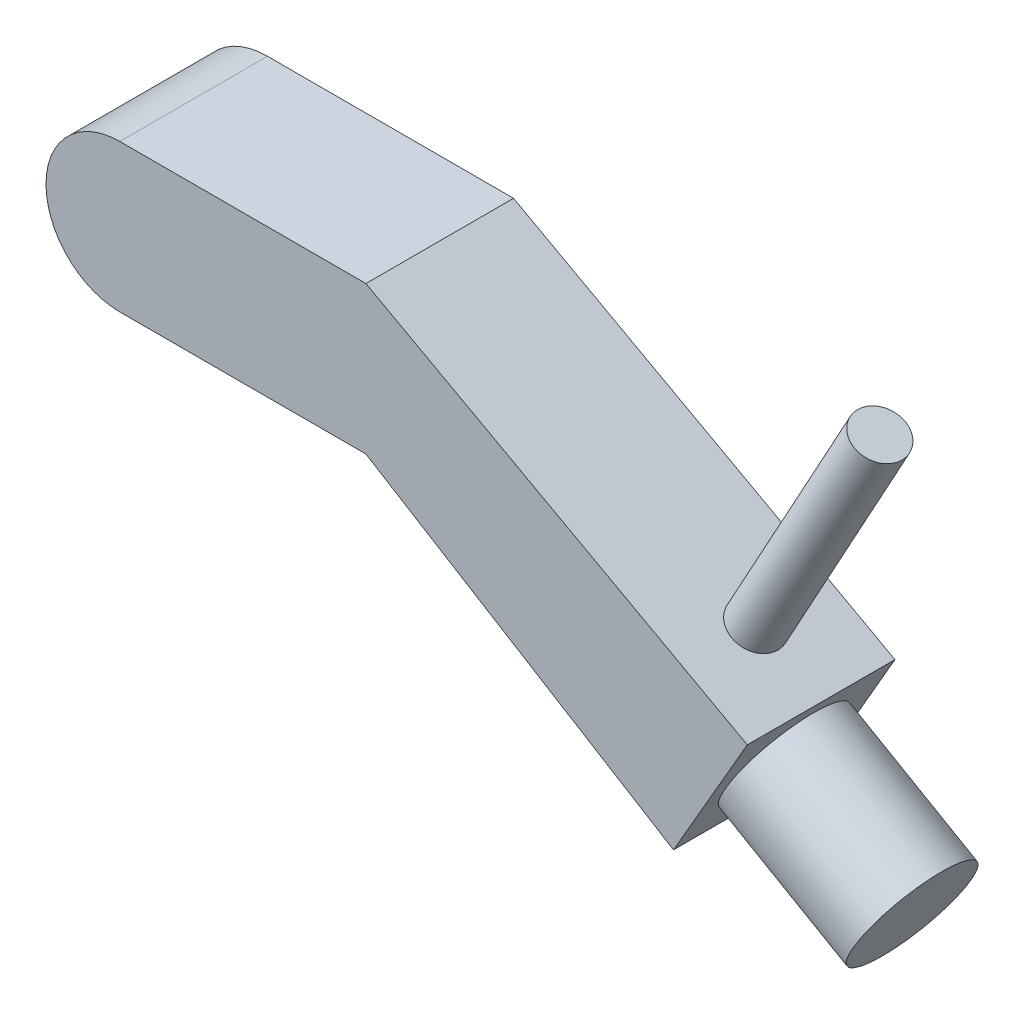
ISO-10303-21;
HEADER;
FILE_DESCRIPTION(('STEP AP214'),'2;1');
FILE_NAME('part.step','',(''),(''),'','','');
FILE_SCHEMA(('AUTOMOTIVE_DESIGN { 1 0 10303 214 1 1 1 1 }'));
ENDSEC;
DATA;
#1=APPLICATION_CONTEXT('core data for automotive mechanical design processes');
#2=APPLICATION_PROTOCOL_DEFINITION('international standard','automotive_design',2000,#1);
#3=PRODUCT_CONTEXT('',#1,'mechanical');
#4=PRODUCT('Part','Part','',(#3));
#5=PRODUCT_RELATED_PRODUCT_CATEGORY('part','',(#4));
#6=PRODUCT_DEFINITION_FORMATION('','',#4);
#7=PRODUCT_DEFINITION_CONTEXT('part definition',#1,'design');
#8=PRODUCT_DEFINITION('design','',#6,#7);
#9=PRODUCT_DEFINITION_SHAPE('','',#8);
#10=(LENGTH_UNIT() NAMED_UNIT(*) SI_UNIT(.MILLI.,.METRE.));
#11=(NAMED_UNIT(*) PLANE_ANGLE_UNIT() SI_UNIT($,.RADIAN.));
#12=(NAMED_UNIT(*) SI_UNIT($,.STERADIAN.) SOLID_ANGLE_UNIT());
#13=UNCERTAINTY_MEASURE_WITH_UNIT(LENGTH_MEASURE(1.E-05),#10,'distance_accuracy_value','');
#14=(GEOMETRIC_REPRESENTATION_CONTEXT(3) GLOBAL_UNCERTAINTY_ASSIGNED_CONTEXT((#13)) GLOBAL_UNIT_ASSIGNED_CONTEXT((#10,
#11,#12)) REPRESENTATION_CONTEXT('',''));
#15=CARTESIAN_POINT('',(0.,0.,0.));
#16=DIRECTION('',(0.,0.,1.));
#17=DIRECTION('',(1.,0.,0.));
#18=AXIS2_PLACEMENT_3D('',#15,#16,#17);
#19=CARTESIAN_POINT('',(50.,15.,15.));
#20=DIRECTION('',(-0.480172354752716,-0.877174161572964,0.));
#21=DIRECTION('',(0.877174161572964,-0.480172354752716,0.));
#22=AXIS2_PLACEMENT_3D('',#19,#20,#21);
#23=PLANE('',#22);
#24=CARTESIAN_POINT('',(114.342387576406,-20.2215524652166,0.));
#25=DIRECTION('',(-0.480172354752716,-0.877174161572964,0.));
#26=DIRECTION('',(0.877174161572964,-0.480172354752716,0.));
#27=AXIS2_PLACEMENT_3D('',#24,#25,#26);
#28=CIRCLE('',#27,5.00000000000002);
#29=CARTESIAN_POINT('',(118.72825838427,-22.6224142389802,0.));
#30=VERTEX_POINT('',#29);
#31=EDGE_CURVE('E11',#30,#30,#28,.F.);
#32=ORIENTED_EDGE('',*,*,#31,.F.);
#33=EDGE_LOOP('',(#32));
#34=FACE_BOUND('',#33,.T.);
#35=DIRECTION('',(-0.877174161572964,0.480172354752716,0.));
#36=VECTOR('',#35,1.);
#37=CARTESIAN_POINT('',(50.,15.,-15.));
#38=LINE('',#37,#36);
#39=CARTESIAN_POINT('',(127.5,-27.4241377865073,-15.));
#40=VERTEX_POINT('',#39);
#41=CARTESIAN_POINT('',(50.,15.,-15.));
#42=VERTEX_POINT('',#41);
#43=EDGE_CURVE('E118',#40,#42,#38,.T.);
#44=ORIENTED_EDGE('',*,*,#43,.T.);
#45=DIRECTION('',(0.,0.,-1.));
#46=VECTOR('',#45,1.);
#47=CARTESIAN_POINT('',(50.,15.,15.));
#48=LINE('',#47,#46);
#49=CARTESIAN_POINT('',(50.,15.,15.));
#50=VERTEX_POINT('',#49);
#51=EDGE_CURVE('E135',#50,#42,#48,.T.);
#52=ORIENTED_EDGE('',*,*,#51,.F.);
#53=DIRECTION('',(-0.877174161572964,0.480172354752716,0.));
#54=VECTOR('',#53,1.);
#55=CARTESIAN_POINT('',(50.,15.,15.));
#56=LINE('',#55,#54);
#57=CARTESIAN_POINT('',(127.5,-27.4241377865073,15.));
#58=VERTEX_POINT('',#57);
#59=EDGE_CURVE('E129',#58,#50,#56,.T.);
#60=ORIENTED_EDGE('',*,*,#59,.F.);
#61=DIRECTION('',(0.,0.,-1.));
#62=VECTOR('',#61,1.);
#63=CARTESIAN_POINT('',(127.5,-27.4241377865073,15.));
#64=LINE('',#63,#62);
#65=EDGE_CURVE('E114',#58,#40,#64,.T.);
#66=ORIENTED_EDGE('',*,*,#65,.T.);
#67=EDGE_LOOP('',(#44,#52,#60,#66));
#68=FACE_BOUND('',#67,.T.);
#69=ADVANCED_FACE('F33',(#34,#68),#23,.F.);
#70=CARTESIAN_POINT('',(0.,15.,15.));
#71=DIRECTION('',(0.,-1.,0.));
#72=DIRECTION('',(0.,0.,-1.));
#73=AXIS2_PLACEMENT_3D('',#70,#71,#72);
#74=PLANE('',#73);
#75=DIRECTION('',(-1.,0.,0.));
#76=VECTOR('',#75,1.);
#77=CARTESIAN_POINT('',(0.,15.,-15.));
#78=LINE('',#77,#76);
#79=CARTESIAN_POINT('',(0.,15.,-15.));
#80=VERTEX_POINT('',#79);
#81=EDGE_CURVE('E121',#42,#80,#78,.T.);
#82=ORIENTED_EDGE('',*,*,#81,.T.);
#83=DIRECTION('',(0.,0.,-1.));
#84=VECTOR('',#83,1.);
#85=CARTESIAN_POINT('',(0.,15.,15.));
#86=LINE('',#85,#84);
#87=CARTESIAN_POINT('',(0.,15.,15.));
#88=VERTEX_POINT('',#87);
#89=EDGE_CURVE('E133',#88,#80,#86,.T.);
#90=ORIENTED_EDGE('',*,*,#89,.F.);
#91=DIRECTION('',(-1.,0.,0.));
#92=VECTOR('',#91,1.);
#93=CARTESIAN_POINT('',(0.,15.,15.));
#94=LINE('',#93,#92);
#95=EDGE_CURVE('E87',#50,#88,#94,.T.);
#96=ORIENTED_EDGE('',*,*,#95,.F.);
#97=ORIENTED_EDGE('',*,*,#51,.T.);
#98=EDGE_LOOP('',(#82,#90,#96,#97));
#99=FACE_BOUND('',#98,.T.);
#100=ADVANCED_FACE('F146',(#99),#74,.F.);
#101=CARTESIAN_POINT('',(0.,0.,15.));
#102=DIRECTION('',(0.,0.,-1.));
#103=DIRECTION('',(-1.,0.,0.));
#104=AXIS2_PLACEMENT_3D('',#101,#102,#103);
#105=CYLINDRICAL_SURFACE('',#104,15.);
#106=CARTESIAN_POINT('',(0.,0.,-15.));
#107=DIRECTION('',(0.,0.,1.));
#108=DIRECTION('',(1.,0.,0.));
#109=AXIS2_PLACEMENT_3D('',#106,#107,#108);
#110=CIRCLE('',#109,15.);
#111=CARTESIAN_POINT('',(0.,-15.,-15.));
#112=VERTEX_POINT('',#111);
#113=EDGE_CURVE('E124',#80,#112,#110,.T.);
#114=ORIENTED_EDGE('',*,*,#113,.T.);
#115=DIRECTION('',(0.,0.,-1.));
#116=VECTOR('',#115,1.);
#117=CARTESIAN_POINT('',(0.,-15.,15.));
#118=LINE('',#117,#116);
#119=CARTESIAN_POINT('',(0.,-15.,15.));
#120=VERTEX_POINT('',#119);
#121=EDGE_CURVE('E109',#120,#112,#118,.T.);
#122=ORIENTED_EDGE('',*,*,#121,.F.);
#123=CARTESIAN_POINT('',(0.,0.,15.));
#124=DIRECTION('',(0.,0.,1.));
#125=DIRECTION('',(1.,0.,0.));
#126=AXIS2_PLACEMENT_3D('',#123,#124,#125);
#127=CIRCLE('',#126,15.);
#128=EDGE_CURVE('E100',#88,#120,#127,.T.);
#129=ORIENTED_EDGE('',*,*,#128,.F.);
#130=ORIENTED_EDGE('',*,*,#89,.T.);
#131=EDGE_LOOP('',(#114,#122,#129,#130));
#132=FACE_BOUND('',#131,.T.);
#133=ADVANCED_FACE('F149',(#132),#105,.T.);
#134=CARTESIAN_POINT('',(0.,-15.,15.));
#135=DIRECTION('',(0.,1.,0.));
#136=DIRECTION('',(0.,0.,1.));
#137=AXIS2_PLACEMENT_3D('',#134,#135,#136);
#138=PLANE('',#137);
#139=DIRECTION('',(1.,0.,0.));
#140=VECTOR('',#139,1.);
#141=CARTESIAN_POINT('',(0.,-15.,-15.));
#142=LINE('',#141,#140);
#143=CARTESIAN_POINT('',(50.,-15.,-15.));
#144=VERTEX_POINT('',#143);
#145=EDGE_CURVE('E108',#112,#144,#142,.T.);
#146=ORIENTED_EDGE('',*,*,#145,.T.);
#147=DIRECTION('',(0.,0.,-1.));
#148=VECTOR('',#147,1.);
#149=CARTESIAN_POINT('',(50.,-15.,15.));
#150=LINE('',#149,#148);
#151=CARTESIAN_POINT('',(50.,-15.,15.));
#152=VERTEX_POINT('',#151);
#153=EDGE_CURVE('E105',#152,#144,#150,.T.);
#154=ORIENTED_EDGE('',*,*,#153,.F.);
#155=DIRECTION('',(1.,0.,0.));
#156=VECTOR('',#155,1.);
#157=CARTESIAN_POINT('',(0.,-15.,15.));
#158=LINE('',#157,#156);
#159=EDGE_CURVE('E94',#120,#152,#158,.T.);
#160=ORIENTED_EDGE('',*,*,#159,.F.);
#161=ORIENTED_EDGE('',*,*,#121,.T.);
#162=EDGE_LOOP('',(#146,#154,#160,#161));
#163=FACE_BOUND('',#162,.T.);
#164=ADVANCED_FACE('F106',(#163),#138,.F.);
#165=CARTESIAN_POINT('',(50.,-15.,15.));
#166=DIRECTION('',(0.523537291782089,0.852002760625502,0.));
#167=DIRECTION('',(-0.852002760625502,0.523537291782089,0.));
#168=AXIS2_PLACEMENT_3D('',#165,#166,#167);
#169=PLANE('',#168);
#170=DIRECTION('',(0.852002760625502,-0.523537291782089,0.));
#171=VECTOR('',#170,1.);
#172=CARTESIAN_POINT('',(50.,-15.,-15.));
#173=LINE('',#172,#171);
#174=CARTESIAN_POINT('',(112.5,-53.4048999000405,-15.));
#175=VERTEX_POINT('',#174);
#176=EDGE_CURVE('E72',#144,#175,#173,.T.);
#177=ORIENTED_EDGE('',*,*,#176,.T.);
#178=DIRECTION('',(0.,0.,-1.));
#179=VECTOR('',#178,1.);
#180=CARTESIAN_POINT('',(112.5,-53.4048999000405,15.));
#181=LINE('',#180,#179);
#182=CARTESIAN_POINT('',(112.5,-53.4048999000405,15.));
#183=VERTEX_POINT('',#182);
#184=EDGE_CURVE('E110',#183,#175,#181,.T.);
#185=ORIENTED_EDGE('',*,*,#184,.F.);
#186=DIRECTION('',(0.852002760625502,-0.523537291782089,0.));
#187=VECTOR('',#186,1.);
#188=CARTESIAN_POINT('',(50.,-15.,15.));
#189=LINE('',#188,#187);
#190=EDGE_CURVE('E98',#152,#183,#189,.T.);
#191=ORIENTED_EDGE('',*,*,#190,.F.);
#192=ORIENTED_EDGE('',*,*,#153,.T.);
#193=EDGE_LOOP('',(#177,#185,#191,#192));
#194=FACE_BOUND('',#193,.T.);
#195=ADVANCED_FACE('F112',(#194),#169,.F.);
#196=CARTESIAN_POINT('',(127.5,-27.4241377865073,15.));
#197=DIRECTION('',(-0.866025403784438,0.500000000000001,0.));
#198=DIRECTION('',(-0.500000000000001,-0.866025403784438,0.));
#199=AXIS2_PLACEMENT_3D('',#196,#197,#198);
#200=PLANE('',#199);
#201=CARTESIAN_POINT('',(120.,-40.4145188432739,0.));
#202=DIRECTION('',(0.866025403784438,-0.500000000000001,0.));
#203=DIRECTION('',(0.500000000000001,0.866025403784438,0.));
#204=AXIS2_PLACEMENT_3D('',#201,#202,#203);
#205=CIRCLE('',#204,12.);
#206=CARTESIAN_POINT('',(114.,-50.8068236886872,0.));
#207=VERTEX_POINT('',#206);
#208=EDGE_CURVE('E41',#207,#207,#205,.T.);
#209=ORIENTED_EDGE('',*,*,#208,.F.);
#210=EDGE_LOOP('',(#209));
#211=FACE_BOUND('',#210,.T.);
#212=DIRECTION('',(0.500000000000001,0.866025403784438,0.));
#213=VECTOR('',#212,1.);
#214=CARTESIAN_POINT('',(127.5,-27.4241377865073,-15.));
#215=LINE('',#214,#213);
#216=EDGE_CURVE('E78',#175,#40,#215,.T.);
#217=ORIENTED_EDGE('',*,*,#216,.T.);
#218=ORIENTED_EDGE('',*,*,#65,.F.);
#219=DIRECTION('',(0.500000000000001,0.866025403784438,0.));
#220=VECTOR('',#219,1.);
#221=CARTESIAN_POINT('',(127.5,-27.4241377865073,15.));
#222=LINE('',#221,#220);
#223=EDGE_CURVE('E49',#183,#58,#222,.T.);
#224=ORIENTED_EDGE('',*,*,#223,.F.);
#225=ORIENTED_EDGE('',*,*,#184,.T.);
#226=EDGE_LOOP('',(#217,#218,#224,#225));
#227=FACE_BOUND('',#226,.T.);
#228=ADVANCED_FACE('F154',(#211,#227),#200,.F.);
#229=CARTESIAN_POINT('',(0.,0.,15.));
#230=DIRECTION('',(0.,0.,1.));
#231=DIRECTION('',(1.,0.,0.));
#232=AXIS2_PLACEMENT_3D('',#229,#230,#231);
#233=PLANE('',#232);
#234=ORIENTED_EDGE('',*,*,#59,.T.);
#235=ORIENTED_EDGE('',*,*,#95,.T.);
#236=ORIENTED_EDGE('',*,*,#128,.T.);
#237=ORIENTED_EDGE('',*,*,#159,.T.);
#238=ORIENTED_EDGE('',*,*,#190,.T.);
#239=ORIENTED_EDGE('',*,*,#223,.T.);
#240=EDGE_LOOP('',(#234,#235,#236,#237,#238,#239));
#241=FACE_BOUND('',#240,.T.);
#242=ADVANCED_FACE('F96',(#241),#233,.T.);
#243=CARTESIAN_POINT('',(0.,0.,-15.));
#244=DIRECTION('',(0.,0.,1.));
#245=DIRECTION('',(1.,0.,0.));
#246=AXIS2_PLACEMENT_3D('',#243,#244,#245);
#247=PLANE('',#246);
#248=ORIENTED_EDGE('',*,*,#43,.F.);
#249=ORIENTED_EDGE('',*,*,#216,.F.);
#250=ORIENTED_EDGE('',*,*,#176,.F.);
#251=ORIENTED_EDGE('',*,*,#145,.F.);
#252=ORIENTED_EDGE('',*,*,#113,.F.);
#253=ORIENTED_EDGE('',*,*,#81,.F.);
#254=EDGE_LOOP('',(#248,#249,#250,#251,#252,#253));
#255=FACE_BOUND('',#254,.T.);
#256=ADVANCED_FACE('F152',(#255),#247,.F.);
#257=CARTESIAN_POINT('',(145.980762113533,-55.414518843274,0.));
#258=DIRECTION('',(-0.866025403784438,0.500000000000001,0.));
#259=DIRECTION('',(-0.500000000000001,-0.866025403784438,0.));
#260=AXIS2_PLACEMENT_3D('',#257,#258,#259);
#261=CYLINDRICAL_SURFACE('',#260,12.);
#262=CARTESIAN_POINT('',(145.980762113533,-55.414518843274,0.));
#263=DIRECTION('',(0.866025403784438,-0.500000000000001,0.));
#264=DIRECTION('',(0.500000000000001,0.866025403784438,0.));
#265=AXIS2_PLACEMENT_3D('',#262,#263,#264);
#266=CIRCLE('',#265,12.);
#267=CARTESIAN_POINT('',(139.980762113533,-65.8068236886872,0.));
#268=VERTEX_POINT('',#267);
#269=EDGE_CURVE('E122',#268,#268,#266,.T.);
#270=CARTESIAN_POINT('',(139.980762113533,-65.8068236886872,0.));
#271=CARTESIAN_POINT('',(139.710129174851,-65.6505736886872,0.));
#272=CARTESIAN_POINT('',(139.439496236168,-65.4943236886872,0.));
#273=CARTESIAN_POINT('',(138.898230358803,-65.1818236886872,0.));
#274=CARTESIAN_POINT('',(138.62759742012,-65.0255736886872,0.));
#275=CARTESIAN_POINT('',(138.086331542755,-64.7130736886872,0.));
#276=CARTESIAN_POINT('',(137.815698604072,-64.5568236886872,0.));
#277=CARTESIAN_POINT('',(137.274432726707,-64.2443236886872,0.));
#278=CARTESIAN_POINT('',(137.003799788024,-64.0880736886872,0.));
#279=CARTESIAN_POINT('',(136.462533910659,-63.7755736886872,0.));
#280=CARTESIAN_POINT('',(136.191900971976,-63.6193236886872,0.));
#281=CARTESIAN_POINT('',(135.650635094611,-63.3068236886872,0.));
#282=CARTESIAN_POINT('',(135.380002155928,-63.1505736886872,0.));
#283=CARTESIAN_POINT('',(134.838736278563,-62.8380736886872,0.));
#284=CARTESIAN_POINT('',(134.56810333988,-62.6818236886872,0.));
#285=CARTESIAN_POINT('',(134.026837462515,-62.3693236886872,0.));
#286=CARTESIAN_POINT('',(133.756204523833,-62.2130736886872,0.));
#287=CARTESIAN_POINT('',(133.214938646467,-61.9005736886872,0.));
#288=CARTESIAN_POINT('',(132.944305707785,-61.7443236886872,0.));
#289=CARTESIAN_POINT('',(132.403039830419,-61.4318236886872,0.));
#290=CARTESIAN_POINT('',(132.132406891737,-61.2755736886872,0.));
#291=CARTESIAN_POINT('',(131.591141014371,-60.9630736886872,0.));
#292=CARTESIAN_POINT('',(131.320508075689,-60.8068236886872,0.));
#293=CARTESIAN_POINT('',(130.779242198324,-60.4943236886872,0.));
#294=CARTESIAN_POINT('',(130.508609259641,-60.3380736886872,0.));
#295=CARTESIAN_POINT('',(129.967343382276,-60.0255736886872,0.));
#296=CARTESIAN_POINT('',(129.696710443593,-59.8693236886872,0.));
#297=CARTESIAN_POINT('',(129.155444566228,-59.5568236886872,0.));
#298=CARTESIAN_POINT('',(128.884811627545,-59.4005736886872,0.));
#299=CARTESIAN_POINT('',(128.34354575018,-59.0880736886872,0.));
#300=CARTESIAN_POINT('',(128.072912811497,-58.9318236886872,0.));
#301=CARTESIAN_POINT('',(127.531646934132,-58.6193236886872,0.));
#302=CARTESIAN_POINT('',(127.261013995449,-58.4630736886872,0.));
#303=CARTESIAN_POINT('',(126.719748118084,-58.1505736886872,0.));
#304=CARTESIAN_POINT('',(126.449115179401,-57.9943236886872,0.));
#305=CARTESIAN_POINT('',(125.907849302036,-57.6818236886872,0.));
#306=CARTESIAN_POINT('',(125.637216363353,-57.5255736886872,0.));
#307=CARTESIAN_POINT('',(125.095950485988,-57.2130736886872,0.));
#308=CARTESIAN_POINT('',(124.825317547306,-57.0568236886872,0.));
#309=CARTESIAN_POINT('',(124.28405166994,-56.7443236886872,0.));
#310=CARTESIAN_POINT('',(124.013418731258,-56.5880736886872,0.));
#311=CARTESIAN_POINT('',(123.472152853892,-56.2755736886872,0.));
#312=CARTESIAN_POINT('',(123.20151991521,-56.1193236886872,0.));
#313=CARTESIAN_POINT('',(122.660254037844,-55.8068236886872,0.));
#314=CARTESIAN_POINT('',(122.389621099162,-55.6505736886872,0.));
#315=CARTESIAN_POINT('',(121.848355221797,-55.3380736886872,0.));
#316=CARTESIAN_POINT('',(121.577722283114,-55.1818236886872,0.));
#317=CARTESIAN_POINT('',(121.036456405749,-54.8693236886872,0.));
#318=CARTESIAN_POINT('',(120.765823467066,-54.7130736886872,0.));
#319=CARTESIAN_POINT('',(120.224557589701,-54.4005736886872,0.));
#320=CARTESIAN_POINT('',(119.953924651018,-54.2443236886872,0.));
#321=CARTESIAN_POINT('',(119.412658773653,-53.9318236886872,0.));
#322=CARTESIAN_POINT('',(119.14202583497,-53.7755736886872,0.));
#323=CARTESIAN_POINT('',(118.600759957605,-53.4630736886872,0.));
#324=CARTESIAN_POINT('',(118.330127018922,-53.3068236886872,0.));
#325=CARTESIAN_POINT('',(117.788861141557,-52.9943236886872,0.));
#326=CARTESIAN_POINT('',(117.518228202874,-52.8380736886872,0.));
#327=CARTESIAN_POINT('',(116.976962325509,-52.5255736886872,0.));
#328=CARTESIAN_POINT('',(116.706329386826,-52.3693236886872,0.));
#329=CARTESIAN_POINT('',(116.165063509461,-52.0568236886872,0.));
#330=CARTESIAN_POINT('',(115.894430570779,-51.9005736886872,0.));
#331=CARTESIAN_POINT('',(115.353164693413,-51.5880736886872,0.));
#332=CARTESIAN_POINT('',(115.082531754731,-51.4318236886872,0.));
#333=CARTESIAN_POINT('',(114.541265877365,-51.1193236886872,0.));
#334=CARTESIAN_POINT('',(114.270632938683,-50.9630736886872,0.));
#335=CARTESIAN_POINT('',(114.,-50.8068236886872,0.));
#336=B_SPLINE_CURVE_WITH_KNOTS('',3,(#270,#271,#272,#273,#274,#275,#276,#277,#278,#279,#280,
#281,#282,#283,#284,#285,#286,#287,#288,#289,#290,#291,#292,#293,#294,#295,#296,#297,#298,#299,
#300,#301,#302,#303,#304,#305,#306,#307,#308,#309,#310,#311,#312,#313,#314,#315,#316,#317,#318,
#319,#320,#321,#322,#323,#324,#325,#326,#327,#328,#329,#330,#331,#332,#333,#334,#335),
.UNSPECIFIED.,.F.,.F.,(4,2,2,2,2,2,2,2,2,2,2,2,2,2,2,2,2,2,2,2,2,2,2,2,2,2,2,2,2,2,2,2,4),(0.,
0.937500000000017,1.87500000000001,2.8125,3.75000000000001,4.68750000000001,5.625,
6.56250000000002,7.50000000000001,8.4375,9.37500000000002,10.3125,11.25,12.1875,13.125,14.0625,
15.,15.9375,16.875,17.8125,18.75,19.6875,20.625,21.5625,22.5,23.4375,24.375,25.3125,26.25,
27.1875,28.125,29.0625,30.),.UNSPECIFIED.);
#337=EDGE_CURVE('BSEAM185',#268,#207,#336,.T.);
#338=ORIENTED_EDGE('',*,*,#269,.F.);
#339=ORIENTED_EDGE('',*,*,#208,.T.);
#340=ORIENTED_EDGE('',*,*,#337,.T.);
#341=ORIENTED_EDGE('',*,*,#337,.F.);
#342=EDGE_LOOP('',(#338,#340,#339,#341));
#343=FACE_BOUND('',#342,.T.);
#344=ADVANCED_FACE('F185',(#343),#261,.T.);
#345=CARTESIAN_POINT('',(145.980762113533,-55.414518843274,0.));
#346=DIRECTION('',(0.866025403784438,-0.500000000000001,0.));
#347=DIRECTION('',(0.500000000000001,0.866025403784438,0.));
#348=AXIS2_PLACEMENT_3D('',#345,#346,#347);
#349=PLANE('',#348);
#350=ORIENTED_EDGE('',*,*,#269,.T.);
#351=EDGE_LOOP('',(#350));
#352=FACE_BOUND('',#351,.T.);
#353=ADVANCED_FACE('F177',(#352),#349,.T.);
#354=CARTESIAN_POINT('',(146.216010228376,38.0048696711295,0.));
#355=DIRECTION('',(-0.480172354752716,-0.877174161572964,0.));
#356=DIRECTION('',(0.877174161572964,-0.480172354752716,0.));
#357=AXIS2_PLACEMENT_3D('',#354,#355,#356);
#358=CYLINDRICAL_SURFACE('',#357,5.00000000000002);
#359=CARTESIAN_POINT('',(139.421339969104,25.5924324934194,0.));
#360=DIRECTION('',(-0.437024557371536,-0.899449574047491,0.));
#361=DIRECTION('',(-0.899449574047491,0.437024557371536,0.));
#362=AXIS2_PLACEMENT_3D('',#359,#360,#361);
#363=ELLIPSE('',#362,5.00590177402386,5.00000000000002);
#364=CARTESIAN_POINT('',(134.918783750735,27.7801345004575,0.));
#365=VERTEX_POINT('',#364);
#366=EDGE_CURVE('E264',#365,#365,#363,.T.);
#367=ORIENTED_EDGE('',*,*,#366,.T.);
#368=EDGE_LOOP('',(#367));
#369=FACE_BOUND('',#368,.T.);
#370=ORIENTED_EDGE('',*,*,#31,.T.);
#371=EDGE_LOOP('',(#370));
#372=FACE_BOUND('',#371,.T.);
#373=ADVANCED_FACE('F174',(#369,#372),#358,.T.);
#374=CARTESIAN_POINT('',(122.500102158843,33.8141234893144,15.0000000000057));
#375=DIRECTION('',(-0.437024557371536,-0.899449574047491,0.));
#376=DIRECTION('',(-0.899449574047491,0.437024557371536,0.));
#377=AXIS2_PLACEMENT_3D('',#374,#375,#376);
#378=PLANE('',#377);
#379=ORIENTED_EDGE('',*,*,#366,.F.);
#380=EDGE_LOOP('',(#379));
#381=FACE_BOUND('',#380,.T.);
#382=ADVANCED_FACE('F176',(#381),#378,.F.);
#383=CLOSED_SHELL('',(#69,#100,#133,#164,#195,#228,#242,#256,#344,#353,#373,#382));
#384=MANIFOLD_SOLID_BREP('B2',#383);
#385=ADVANCED_BREP_SHAPE_REPRESENTATION('',(#18,#384),#14);
#386=SHAPE_DEFINITION_REPRESENTATION(#9,#385);
ENDSEC;
END-ISO-10303-21;
